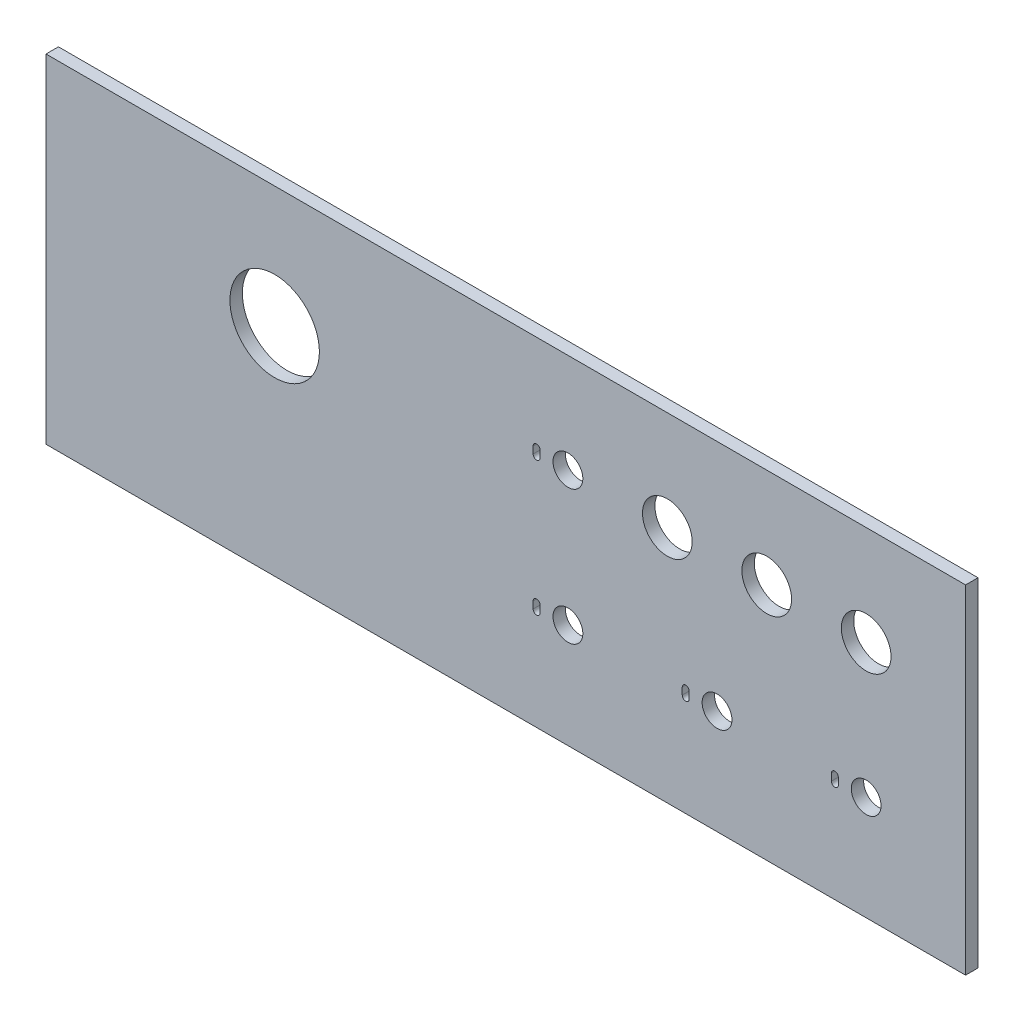
ISO-10303-21;
HEADER;
FILE_DESCRIPTION(('STEP AP214'),'2;1');
FILE_NAME('part.step','',(''),(''),'','','');
FILE_SCHEMA(('AUTOMOTIVE_DESIGN { 1 0 10303 214 1 1 1 1 }'));
ENDSEC;
DATA;
#1=APPLICATION_CONTEXT('core data for automotive mechanical design processes');
#2=APPLICATION_PROTOCOL_DEFINITION('international standard','automotive_design',2000,#1);
#3=PRODUCT_CONTEXT('',#1,'mechanical');
#4=PRODUCT('Part','Part','',(#3));
#5=PRODUCT_RELATED_PRODUCT_CATEGORY('part','',(#4));
#6=PRODUCT_DEFINITION_FORMATION('','',#4);
#7=PRODUCT_DEFINITION_CONTEXT('part definition',#1,'design');
#8=PRODUCT_DEFINITION('design','',#6,#7);
#9=PRODUCT_DEFINITION_SHAPE('','',#8);
#10=(LENGTH_UNIT() NAMED_UNIT(*) SI_UNIT(.MILLI.,.METRE.));
#11=(NAMED_UNIT(*) PLANE_ANGLE_UNIT() SI_UNIT($,.RADIAN.));
#12=(NAMED_UNIT(*) SI_UNIT($,.STERADIAN.) SOLID_ANGLE_UNIT());
#13=UNCERTAINTY_MEASURE_WITH_UNIT(LENGTH_MEASURE(1.E-05),#10,'distance_accuracy_value','');
#14=(GEOMETRIC_REPRESENTATION_CONTEXT(3) GLOBAL_UNCERTAINTY_ASSIGNED_CONTEXT((#13)) GLOBAL_UNIT_ASSIGNED_CONTEXT((#10,
#11,#12)) REPRESENTATION_CONTEXT('',''));
#15=CARTESIAN_POINT('',(0.,0.,0.));
#16=DIRECTION('',(0.,0.,1.));
#17=DIRECTION('',(1.,0.,0.));
#18=AXIS2_PLACEMENT_3D('',#15,#16,#17);
#19=CARTESIAN_POINT('',(117.475,-43.18,-3.175));
#20=DIRECTION('',(1.,0.,0.));
#21=DIRECTION('',(0.,0.,-1.));
#22=AXIS2_PLACEMENT_3D('',#19,#20,#21);
#23=PLANE('',#22);
#24=DIRECTION('',(0.,1.,0.));
#25=VECTOR('',#24,1.);
#26=CARTESIAN_POINT('',(117.475,-43.18,0.));
#27=LINE('',#26,#25);
#28=CARTESIAN_POINT('',(117.475,-43.18,0.));
#29=VERTEX_POINT('',#28);
#30=CARTESIAN_POINT('',(117.475,43.18,0.));
#31=VERTEX_POINT('',#30);
#32=EDGE_CURVE('E339',#29,#31,#27,.T.);
#33=ORIENTED_EDGE('',*,*,#32,.F.);
#34=DIRECTION('',(0.,0.,1.));
#35=VECTOR('',#34,1.);
#36=CARTESIAN_POINT('',(117.475,-43.18,-3.175));
#37=LINE('',#36,#35);
#38=CARTESIAN_POINT('',(117.475,-43.18,-3.175));
#39=VERTEX_POINT('',#38);
#40=EDGE_CURVE('E11',#39,#29,#37,.T.);
#41=ORIENTED_EDGE('',*,*,#40,.F.);
#42=DIRECTION('',(0.,1.,0.));
#43=VECTOR('',#42,1.);
#44=CARTESIAN_POINT('',(117.475,-43.18,-3.175));
#45=LINE('',#44,#43);
#46=CARTESIAN_POINT('',(117.475,43.18,-3.175));
#47=VERTEX_POINT('',#46);
#48=EDGE_CURVE('E354',#39,#47,#45,.T.);
#49=ORIENTED_EDGE('',*,*,#48,.T.);
#50=DIRECTION('',(0.,0.,1.));
#51=VECTOR('',#50,1.);
#52=CARTESIAN_POINT('',(117.475,43.18,-3.175));
#53=LINE('',#52,#51);
#54=EDGE_CURVE('E41',#47,#31,#53,.T.);
#55=ORIENTED_EDGE('',*,*,#54,.T.);
#56=EDGE_LOOP('',(#33,#41,#49,#55));
#57=FACE_BOUND('',#56,.T.);
#58=ADVANCED_FACE('F38',(#57),#23,.T.);
#59=CARTESIAN_POINT('',(-117.475,-43.18,-3.175));
#60=DIRECTION('',(0.,-1.,0.));
#61=DIRECTION('',(0.,0.,-1.));
#62=AXIS2_PLACEMENT_3D('',#59,#60,#61);
#63=PLANE('',#62);
#64=DIRECTION('',(1.,0.,0.));
#65=VECTOR('',#64,1.);
#66=CARTESIAN_POINT('',(-117.475,-43.18,0.));
#67=LINE('',#66,#65);
#68=CARTESIAN_POINT('',(-117.475,-43.18,0.));
#69=VERTEX_POINT('',#68);
#70=EDGE_CURVE('E358',#69,#29,#67,.T.);
#71=ORIENTED_EDGE('',*,*,#70,.F.);
#72=DIRECTION('',(0.,0.,1.));
#73=VECTOR('',#72,1.);
#74=CARTESIAN_POINT('',(-117.475,-43.18,-3.175));
#75=LINE('',#74,#73);
#76=CARTESIAN_POINT('',(-117.475,-43.18,-3.175));
#77=VERTEX_POINT('',#76);
#78=EDGE_CURVE('E46',#77,#69,#75,.T.);
#79=ORIENTED_EDGE('',*,*,#78,.F.);
#80=DIRECTION('',(1.,0.,0.));
#81=VECTOR('',#80,1.);
#82=CARTESIAN_POINT('',(-117.475,-43.18,-3.175));
#83=LINE('',#82,#81);
#84=EDGE_CURVE('E364',#77,#39,#83,.T.);
#85=ORIENTED_EDGE('',*,*,#84,.T.);
#86=ORIENTED_EDGE('',*,*,#40,.T.);
#87=EDGE_LOOP('',(#71,#79,#85,#86));
#88=FACE_BOUND('',#87,.T.);
#89=ADVANCED_FACE('F390',(#88),#63,.T.);
#90=CARTESIAN_POINT('',(-117.475,-43.18,-3.175));
#91=DIRECTION('',(-1.,0.,0.));
#92=DIRECTION('',(0.,0.,1.));
#93=AXIS2_PLACEMENT_3D('',#90,#91,#92);
#94=PLANE('',#93);
#95=DIRECTION('',(0.,-1.,0.));
#96=VECTOR('',#95,1.);
#97=CARTESIAN_POINT('',(-117.475,-43.18,0.));
#98=LINE('',#97,#96);
#99=CARTESIAN_POINT('',(-117.475,43.18,0.));
#100=VERTEX_POINT('',#99);
#101=EDGE_CURVE('E372',#100,#69,#98,.T.);
#102=ORIENTED_EDGE('',*,*,#101,.F.);
#103=DIRECTION('',(0.,0.,1.));
#104=VECTOR('',#103,1.);
#105=CARTESIAN_POINT('',(-117.475,43.18,-3.175));
#106=LINE('',#105,#104);
#107=CARTESIAN_POINT('',(-117.475,43.18,-3.175));
#108=VERTEX_POINT('',#107);
#109=EDGE_CURVE('E377',#108,#100,#106,.T.);
#110=ORIENTED_EDGE('',*,*,#109,.F.);
#111=DIRECTION('',(0.,-1.,0.));
#112=VECTOR('',#111,1.);
#113=CARTESIAN_POINT('',(-117.475,-43.18,-3.175));
#114=LINE('',#113,#112);
#115=EDGE_CURVE('E361',#108,#77,#114,.T.);
#116=ORIENTED_EDGE('',*,*,#115,.T.);
#117=ORIENTED_EDGE('',*,*,#78,.T.);
#118=EDGE_LOOP('',(#102,#110,#116,#117));
#119=FACE_BOUND('',#118,.T.);
#120=ADVANCED_FACE('F395',(#119),#94,.T.);
#121=CARTESIAN_POINT('',(-117.475,43.18,-3.175));
#122=DIRECTION('',(0.,1.,0.));
#123=DIRECTION('',(0.,0.,1.));
#124=AXIS2_PLACEMENT_3D('',#121,#122,#123);
#125=PLANE('',#124);
#126=DIRECTION('',(-1.,0.,0.));
#127=VECTOR('',#126,1.);
#128=CARTESIAN_POINT('',(-117.475,43.18,0.));
#129=LINE('',#128,#127);
#130=EDGE_CURVE('E369',#31,#100,#129,.T.);
#131=ORIENTED_EDGE('',*,*,#130,.F.);
#132=ORIENTED_EDGE('',*,*,#54,.F.);
#133=DIRECTION('',(-1.,0.,0.));
#134=VECTOR('',#133,1.);
#135=CARTESIAN_POINT('',(-117.475,43.18,-3.175));
#136=LINE('',#135,#134);
#137=EDGE_CURVE('E357',#47,#108,#136,.T.);
#138=ORIENTED_EDGE('',*,*,#137,.T.);
#139=ORIENTED_EDGE('',*,*,#109,.T.);
#140=EDGE_LOOP('',(#131,#132,#138,#139));
#141=FACE_BOUND('',#140,.T.);
#142=ADVANCED_FACE('F385',(#141),#125,.T.);
#143=CARTESIAN_POINT('',(0.,0.,-3.175));
#144=DIRECTION('',(0.,0.,-1.));
#145=DIRECTION('',(-1.,0.,0.));
#146=AXIS2_PLACEMENT_3D('',#143,#144,#145);
#147=PLANE('',#146);
#148=CARTESIAN_POINT('',(15.875,17.78,-3.175));
#149=DIRECTION('',(0.,0.,1.));
#150=DIRECTION('',(1.,0.,0.));
#151=AXIS2_PLACEMENT_3D('',#148,#149,#150);
#152=CIRCLE('',#151,3.81);
#153=CARTESIAN_POINT('',(19.685,17.78,-3.175));
#154=VERTEX_POINT('',#153);
#155=EDGE_CURVE('E221',#154,#154,#152,.T.);
#156=ORIENTED_EDGE('',*,*,#155,.T.);
#157=EDGE_LOOP('',(#156));
#158=FACE_BOUND('',#157,.T.);
#159=CARTESIAN_POINT('',(7.87399999999997,18.669,-3.175));
#160=DIRECTION('',(0.,0.,1.));
#161=DIRECTION('',(1.,0.,0.));
#162=AXIS2_PLACEMENT_3D('',#159,#160,#161);
#163=CIRCLE('',#162,0.889000000000001);
#164=CARTESIAN_POINT('',(8.76299999999997,18.669,-3.175));
#165=VERTEX_POINT('',#164);
#166=CARTESIAN_POINT('',(6.98499999999997,18.669,-3.175));
#167=VERTEX_POINT('',#166);
#168=EDGE_CURVE('E177',#165,#167,#163,.T.);
#169=ORIENTED_EDGE('',*,*,#168,.T.);
#170=DIRECTION('',(0.,-1.,0.));
#171=VECTOR('',#170,1.);
#172=CARTESIAN_POINT('',(6.98499999999997,18.669,-3.175));
#173=LINE('',#172,#171);
#174=CARTESIAN_POINT('',(6.98499999999997,16.891,-3.175));
#175=VERTEX_POINT('',#174);
#176=EDGE_CURVE('E186',#167,#175,#173,.T.);
#177=ORIENTED_EDGE('',*,*,#176,.T.);
#178=CARTESIAN_POINT('',(7.87399999999997,16.891,-3.175));
#179=DIRECTION('',(0.,0.,1.));
#180=DIRECTION('',(1.,0.,0.));
#181=AXIS2_PLACEMENT_3D('',#178,#179,#180);
#182=CIRCLE('',#181,0.889000000000001);
#183=CARTESIAN_POINT('',(8.76299999999997,16.891,-3.175));
#184=VERTEX_POINT('',#183);
#185=EDGE_CURVE('E54',#175,#184,#182,.T.);
#186=ORIENTED_EDGE('',*,*,#185,.T.);
#187=DIRECTION('',(0.,1.,0.));
#188=VECTOR('',#187,1.);
#189=CARTESIAN_POINT('',(8.76299999999997,18.669,-3.175));
#190=LINE('',#189,#188);
#191=EDGE_CURVE('E183',#184,#165,#190,.T.);
#192=ORIENTED_EDGE('',*,*,#191,.T.);
#193=EDGE_LOOP('',(#169,#177,#186,#192));
#194=FACE_BOUND('',#193,.T.);
#195=CARTESIAN_POINT('',(-59.055,12.192,-3.175));
#196=DIRECTION('',(0.,0.,1.));
#197=DIRECTION('',(1.,0.,0.));
#198=AXIS2_PLACEMENT_3D('',#195,#196,#197);
#199=CIRCLE('',#198,11.43);
#200=CARTESIAN_POINT('',(-47.625,12.192,-3.175));
#201=VERTEX_POINT('',#200);
#202=EDGE_CURVE('E214',#201,#201,#199,.T.);
#203=ORIENTED_EDGE('',*,*,#202,.T.);
#204=EDGE_LOOP('',(#203));
#205=FACE_BOUND('',#204,.T.);
#206=CARTESIAN_POINT('',(92.075,-16.51,-3.175));
#207=DIRECTION('',(0.,0.,1.));
#208=DIRECTION('',(1.,0.,0.));
#209=AXIS2_PLACEMENT_3D('',#206,#207,#208);
#210=CIRCLE('',#209,3.81000000000001);
#211=CARTESIAN_POINT('',(95.885,-16.51,-3.175));
#212=VERTEX_POINT('',#211);
#213=EDGE_CURVE('E222',#212,#212,#210,.T.);
#214=ORIENTED_EDGE('',*,*,#213,.T.);
#215=EDGE_LOOP('',(#214));
#216=FACE_BOUND('',#215,.T.);
#217=CARTESIAN_POINT('',(45.974,-15.621,-3.175));
#218=DIRECTION('',(0.,0.,1.));
#219=DIRECTION('',(1.,0.,0.));
#220=AXIS2_PLACEMENT_3D('',#217,#218,#219);
#221=CIRCLE('',#220,0.889000000000001);
#222=CARTESIAN_POINT('',(46.863,-15.621,-3.175));
#223=VERTEX_POINT('',#222);
#224=CARTESIAN_POINT('',(45.085,-15.621,-3.175));
#225=VERTEX_POINT('',#224);
#226=EDGE_CURVE('E264',#223,#225,#221,.T.);
#227=ORIENTED_EDGE('',*,*,#226,.T.);
#228=DIRECTION('',(0.,-1.,0.));
#229=VECTOR('',#228,1.);
#230=CARTESIAN_POINT('',(45.085,-15.621,-3.175));
#231=LINE('',#230,#229);
#232=CARTESIAN_POINT('',(45.085,-17.399,-3.175));
#233=VERTEX_POINT('',#232);
#234=EDGE_CURVE('E267',#225,#233,#231,.T.);
#235=ORIENTED_EDGE('',*,*,#234,.T.);
#236=CARTESIAN_POINT('',(45.974,-17.399,-3.175));
#237=DIRECTION('',(0.,0.,1.));
#238=DIRECTION('',(1.,0.,0.));
#239=AXIS2_PLACEMENT_3D('',#236,#237,#238);
#240=CIRCLE('',#239,0.889000000000001);
#241=CARTESIAN_POINT('',(46.863,-17.399,-3.175));
#242=VERTEX_POINT('',#241);
#243=EDGE_CURVE('E271',#233,#242,#240,.T.);
#244=ORIENTED_EDGE('',*,*,#243,.T.);
#245=DIRECTION('',(0.,1.,0.));
#246=VECTOR('',#245,1.);
#247=CARTESIAN_POINT('',(46.863,-15.621,-3.175));
#248=LINE('',#247,#246);
#249=EDGE_CURVE('E274',#242,#223,#248,.T.);
#250=ORIENTED_EDGE('',*,*,#249,.T.);
#251=EDGE_LOOP('',(#227,#235,#244,#250));
#252=FACE_BOUND('',#251,.T.);
#253=CARTESIAN_POINT('',(7.87399999999999,-15.621,-3.175));
#254=DIRECTION('',(0.,0.,1.));
#255=DIRECTION('',(1.,0.,0.));
#256=AXIS2_PLACEMENT_3D('',#253,#254,#255);
#257=CIRCLE('',#256,0.888999999999997);
#258=CARTESIAN_POINT('',(8.76299999999999,-15.621,-3.175));
#259=VERTEX_POINT('',#258);
#260=CARTESIAN_POINT('',(6.985,-15.621,-3.175));
#261=VERTEX_POINT('',#260);
#262=EDGE_CURVE('E230',#259,#261,#257,.T.);
#263=ORIENTED_EDGE('',*,*,#262,.T.);
#264=DIRECTION('',(0.,-1.,0.));
#265=VECTOR('',#264,1.);
#266=CARTESIAN_POINT('',(6.985,-15.621,-3.175));
#267=LINE('',#266,#265);
#268=CARTESIAN_POINT('',(6.985,-17.399,-3.175));
#269=VERTEX_POINT('',#268);
#270=EDGE_CURVE('E233',#261,#269,#267,.T.);
#271=ORIENTED_EDGE('',*,*,#270,.T.);
#272=CARTESIAN_POINT('',(7.87399999999999,-17.399,-3.175));
#273=DIRECTION('',(0.,0.,1.));
#274=DIRECTION('',(1.,0.,0.));
#275=AXIS2_PLACEMENT_3D('',#272,#273,#274);
#276=CIRCLE('',#275,0.888999999999997);
#277=CARTESIAN_POINT('',(8.76299999999999,-17.399,-3.175));
#278=VERTEX_POINT('',#277);
#279=EDGE_CURVE('E237',#269,#278,#276,.T.);
#280=ORIENTED_EDGE('',*,*,#279,.T.);
#281=DIRECTION('',(0.,1.,0.));
#282=VECTOR('',#281,1.);
#283=CARTESIAN_POINT('',(8.76299999999999,-15.621,-3.175));
#284=LINE('',#283,#282);
#285=EDGE_CURVE('E240',#278,#259,#284,.T.);
#286=ORIENTED_EDGE('',*,*,#285,.T.);
#287=EDGE_LOOP('',(#263,#271,#280,#286));
#288=FACE_BOUND('',#287,.T.);
#289=CARTESIAN_POINT('',(15.875,-16.51,-3.175));
#290=DIRECTION('',(0.,0.,1.));
#291=DIRECTION('',(1.,0.,0.));
#292=AXIS2_PLACEMENT_3D('',#289,#290,#291);
#293=CIRCLE('',#292,3.81);
#294=CARTESIAN_POINT('',(19.685,-16.51,-3.175));
#295=VERTEX_POINT('',#294);
#296=EDGE_CURVE('E301',#295,#295,#293,.T.);
#297=ORIENTED_EDGE('',*,*,#296,.T.);
#298=EDGE_LOOP('',(#297));
#299=FACE_BOUND('',#298,.T.);
#300=CARTESIAN_POINT('',(53.975,-16.51,-3.175));
#301=DIRECTION('',(0.,0.,1.));
#302=DIRECTION('',(1.,0.,0.));
#303=AXIS2_PLACEMENT_3D('',#300,#301,#302);
#304=CIRCLE('',#303,3.81000000000001);
#305=CARTESIAN_POINT('',(57.785,-16.51,-3.175));
#306=VERTEX_POINT('',#305);
#307=EDGE_CURVE('E229',#306,#306,#304,.T.);
#308=ORIENTED_EDGE('',*,*,#307,.T.);
#309=EDGE_LOOP('',(#308));
#310=FACE_BOUND('',#309,.T.);
#311=CARTESIAN_POINT('',(84.0739999999999,-15.621,-3.175));
#312=DIRECTION('',(0.,0.,1.));
#313=DIRECTION('',(1.,0.,0.));
#314=AXIS2_PLACEMENT_3D('',#311,#312,#313);
#315=CIRCLE('',#314,0.889000000000015);
#316=CARTESIAN_POINT('',(84.963,-15.621,-3.175));
#317=VERTEX_POINT('',#316);
#318=CARTESIAN_POINT('',(83.1849999999999,-15.621,-3.175));
#319=VERTEX_POINT('',#318);
#320=EDGE_CURVE('E306',#317,#319,#315,.T.);
#321=ORIENTED_EDGE('',*,*,#320,.T.);
#322=DIRECTION('',(0.,-1.,0.));
#323=VECTOR('',#322,1.);
#324=CARTESIAN_POINT('',(83.1849999999999,-15.621,-3.175));
#325=LINE('',#324,#323);
#326=CARTESIAN_POINT('',(83.1849999999999,-17.399,-3.175));
#327=VERTEX_POINT('',#326);
#328=EDGE_CURVE('E309',#319,#327,#325,.T.);
#329=ORIENTED_EDGE('',*,*,#328,.T.);
#330=CARTESIAN_POINT('',(84.0739999999999,-17.399,-3.175));
#331=DIRECTION('',(0.,0.,1.));
#332=DIRECTION('',(1.,0.,0.));
#333=AXIS2_PLACEMENT_3D('',#330,#331,#332);
#334=CIRCLE('',#333,0.889000000000015);
#335=CARTESIAN_POINT('',(84.963,-17.399,-3.175));
#336=VERTEX_POINT('',#335);
#337=EDGE_CURVE('E313',#327,#336,#334,.T.);
#338=ORIENTED_EDGE('',*,*,#337,.T.);
#339=DIRECTION('',(0.,1.,0.));
#340=VECTOR('',#339,1.);
#341=CARTESIAN_POINT('',(84.963,-15.621,-3.175));
#342=LINE('',#341,#340);
#343=EDGE_CURVE('E316',#336,#317,#342,.T.);
#344=ORIENTED_EDGE('',*,*,#343,.T.);
#345=EDGE_LOOP('',(#321,#329,#338,#344));
#346=FACE_BOUND('',#345,.T.);
#347=CARTESIAN_POINT('',(41.275,17.78,-3.175));
#348=DIRECTION('',(0.,0.,1.));
#349=DIRECTION('',(1.,0.,0.));
#350=AXIS2_PLACEMENT_3D('',#347,#348,#349);
#351=CIRCLE('',#350,6.35);
#352=CARTESIAN_POINT('',(47.625,17.78,-3.175));
#353=VERTEX_POINT('',#352);
#354=EDGE_CURVE('E336',#353,#353,#351,.T.);
#355=ORIENTED_EDGE('',*,*,#354,.T.);
#356=EDGE_LOOP('',(#355));
#357=FACE_BOUND('',#356,.T.);
#358=CARTESIAN_POINT('',(66.675,17.78,-3.175));
#359=DIRECTION('',(0.,0.,1.));
#360=DIRECTION('',(1.,0.,0.));
#361=AXIS2_PLACEMENT_3D('',#358,#359,#360);
#362=CIRCLE('',#361,6.35);
#363=CARTESIAN_POINT('',(73.025,17.78,-3.175));
#364=VERTEX_POINT('',#363);
#365=EDGE_CURVE('E343',#364,#364,#362,.T.);
#366=ORIENTED_EDGE('',*,*,#365,.T.);
#367=EDGE_LOOP('',(#366));
#368=FACE_BOUND('',#367,.T.);
#369=CARTESIAN_POINT('',(92.075,17.78,-3.175));
#370=DIRECTION('',(0.,0.,1.));
#371=DIRECTION('',(1.,0.,0.));
#372=AXIS2_PLACEMENT_3D('',#369,#370,#371);
#373=CIRCLE('',#372,6.35);
#374=CARTESIAN_POINT('',(98.425,17.78,-3.175));
#375=VERTEX_POINT('',#374);
#376=EDGE_CURVE('E349',#375,#375,#373,.T.);
#377=ORIENTED_EDGE('',*,*,#376,.T.);
#378=EDGE_LOOP('',(#377));
#379=FACE_BOUND('',#378,.T.);
#380=ORIENTED_EDGE('',*,*,#48,.F.);
#381=ORIENTED_EDGE('',*,*,#84,.F.);
#382=ORIENTED_EDGE('',*,*,#115,.F.);
#383=ORIENTED_EDGE('',*,*,#137,.F.);
#384=EDGE_LOOP('',(#380,#381,#382,#383));
#385=FACE_BOUND('',#384,.T.);
#386=ADVANCED_FACE('F190',(#158,#194,#205,#216,#252,#288,#299,#310,#346,#357,#368,#379,#385),
#147,.T.);
#387=CARTESIAN_POINT('',(0.,0.,0.));
#388=DIRECTION('',(0.,0.,-1.));
#389=DIRECTION('',(-1.,0.,0.));
#390=AXIS2_PLACEMENT_3D('',#387,#388,#389);
#391=PLANE('',#390);
#392=CARTESIAN_POINT('',(15.875,17.78,0.));
#393=DIRECTION('',(0.,0.,1.));
#394=DIRECTION('',(1.,0.,0.));
#395=AXIS2_PLACEMENT_3D('',#392,#393,#394);
#396=CIRCLE('',#395,3.81);
#397=CARTESIAN_POINT('',(19.685,17.78,0.));
#398=VERTEX_POINT('',#397);
#399=EDGE_CURVE('E199',#398,#398,#396,.T.);
#400=ORIENTED_EDGE('',*,*,#399,.F.);
#401=EDGE_LOOP('',(#400));
#402=FACE_BOUND('',#401,.T.);
#403=DIRECTION('',(0.,-1.,0.));
#404=VECTOR('',#403,1.);
#405=CARTESIAN_POINT('',(6.98499999999997,18.669,0.));
#406=LINE('',#405,#404);
#407=CARTESIAN_POINT('',(6.98499999999997,18.669,0.));
#408=VERTEX_POINT('',#407);
#409=CARTESIAN_POINT('',(6.98499999999997,16.891,0.));
#410=VERTEX_POINT('',#409);
#411=EDGE_CURVE('E205',#408,#410,#406,.T.);
#412=ORIENTED_EDGE('',*,*,#411,.F.);
#413=CARTESIAN_POINT('',(7.87399999999997,18.669,0.));
#414=DIRECTION('',(0.,0.,1.));
#415=DIRECTION('',(1.,0.,0.));
#416=AXIS2_PLACEMENT_3D('',#413,#414,#415);
#417=CIRCLE('',#416,0.889000000000001);
#418=CARTESIAN_POINT('',(8.76299999999997,18.669,0.));
#419=VERTEX_POINT('',#418);
#420=EDGE_CURVE('E62',#419,#408,#417,.T.);
#421=ORIENTED_EDGE('',*,*,#420,.F.);
#422=DIRECTION('',(0.,1.,0.));
#423=VECTOR('',#422,1.);
#424=CARTESIAN_POINT('',(8.76299999999997,18.669,0.));
#425=LINE('',#424,#423);
#426=CARTESIAN_POINT('',(8.76299999999997,16.891,0.));
#427=VERTEX_POINT('',#426);
#428=EDGE_CURVE('E193',#427,#419,#425,.T.);
#429=ORIENTED_EDGE('',*,*,#428,.F.);
#430=CARTESIAN_POINT('',(7.87399999999997,16.891,0.));
#431=DIRECTION('',(0.,0.,1.));
#432=DIRECTION('',(1.,0.,0.));
#433=AXIS2_PLACEMENT_3D('',#430,#431,#432);
#434=CIRCLE('',#433,0.889000000000001);
#435=EDGE_CURVE('E196',#410,#427,#434,.T.);
#436=ORIENTED_EDGE('',*,*,#435,.F.);
#437=EDGE_LOOP('',(#412,#421,#429,#436));
#438=FACE_BOUND('',#437,.T.);
#439=CARTESIAN_POINT('',(-59.055,12.192,0.));
#440=DIRECTION('',(0.,0.,1.));
#441=DIRECTION('',(1.,0.,0.));
#442=AXIS2_PLACEMENT_3D('',#439,#440,#441);
#443=CIRCLE('',#442,11.43);
#444=CARTESIAN_POINT('',(-47.625,12.192,0.));
#445=VERTEX_POINT('',#444);
#446=EDGE_CURVE('E218',#445,#445,#443,.T.);
#447=ORIENTED_EDGE('',*,*,#446,.F.);
#448=EDGE_LOOP('',(#447));
#449=FACE_BOUND('',#448,.T.);
#450=CARTESIAN_POINT('',(92.075,-16.51,0.));
#451=DIRECTION('',(0.,0.,1.));
#452=DIRECTION('',(1.,0.,0.));
#453=AXIS2_PLACEMENT_3D('',#450,#451,#452);
#454=CIRCLE('',#453,3.81000000000001);
#455=CARTESIAN_POINT('',(95.885,-16.51,0.));
#456=VERTEX_POINT('',#455);
#457=EDGE_CURVE('E226',#456,#456,#454,.T.);
#458=ORIENTED_EDGE('',*,*,#457,.F.);
#459=EDGE_LOOP('',(#458));
#460=FACE_BOUND('',#459,.T.);
#461=DIRECTION('',(0.,-1.,0.));
#462=VECTOR('',#461,1.);
#463=CARTESIAN_POINT('',(45.085,-15.621,0.));
#464=LINE('',#463,#462);
#465=CARTESIAN_POINT('',(45.085,-15.621,0.));
#466=VERTEX_POINT('',#465);
#467=CARTESIAN_POINT('',(45.085,-17.399,0.));
#468=VERTEX_POINT('',#467);
#469=EDGE_CURVE('E280',#466,#468,#464,.T.);
#470=ORIENTED_EDGE('',*,*,#469,.F.);
#471=CARTESIAN_POINT('',(45.974,-15.621,0.));
#472=DIRECTION('',(0.,0.,1.));
#473=DIRECTION('',(1.,0.,0.));
#474=AXIS2_PLACEMENT_3D('',#471,#472,#473);
#475=CIRCLE('',#474,0.889000000000001);
#476=CARTESIAN_POINT('',(46.863,-15.621,0.));
#477=VERTEX_POINT('',#476);
#478=EDGE_CURVE('E278',#477,#466,#475,.T.);
#479=ORIENTED_EDGE('',*,*,#478,.F.);
#480=DIRECTION('',(0.,1.,0.));
#481=VECTOR('',#480,1.);
#482=CARTESIAN_POINT('',(46.863,-15.621,0.));
#483=LINE('',#482,#481);
#484=CARTESIAN_POINT('',(46.863,-17.399,0.));
#485=VERTEX_POINT('',#484);
#486=EDGE_CURVE('E268',#485,#477,#483,.T.);
#487=ORIENTED_EDGE('',*,*,#486,.F.);
#488=CARTESIAN_POINT('',(45.974,-17.399,0.));
#489=DIRECTION('',(0.,0.,1.));
#490=DIRECTION('',(1.,0.,0.));
#491=AXIS2_PLACEMENT_3D('',#488,#489,#490);
#492=CIRCLE('',#491,0.889000000000001);
#493=EDGE_CURVE('E284',#468,#485,#492,.T.);
#494=ORIENTED_EDGE('',*,*,#493,.F.);
#495=EDGE_LOOP('',(#470,#479,#487,#494));
#496=FACE_BOUND('',#495,.T.);
#497=DIRECTION('',(0.,-1.,0.));
#498=VECTOR('',#497,1.);
#499=CARTESIAN_POINT('',(6.985,-15.621,0.));
#500=LINE('',#499,#498);
#501=CARTESIAN_POINT('',(6.985,-15.621,0.));
#502=VERTEX_POINT('',#501);
#503=CARTESIAN_POINT('',(6.98499999999999,-17.399,0.));
#504=VERTEX_POINT('',#503);
#505=EDGE_CURVE('E246',#502,#504,#500,.T.);
#506=ORIENTED_EDGE('',*,*,#505,.F.);
#507=CARTESIAN_POINT('',(7.87399999999999,-15.621,0.));
#508=DIRECTION('',(0.,0.,1.));
#509=DIRECTION('',(1.,0.,0.));
#510=AXIS2_PLACEMENT_3D('',#507,#508,#509);
#511=CIRCLE('',#510,0.888999999999997);
#512=CARTESIAN_POINT('',(8.76299999999999,-15.621,0.));
#513=VERTEX_POINT('',#512);
#514=EDGE_CURVE('E244',#513,#502,#511,.T.);
#515=ORIENTED_EDGE('',*,*,#514,.F.);
#516=DIRECTION('',(0.,1.,0.));
#517=VECTOR('',#516,1.);
#518=CARTESIAN_POINT('',(8.76299999999999,-15.621,0.));
#519=LINE('',#518,#517);
#520=CARTESIAN_POINT('',(8.76299999999999,-17.399,0.));
#521=VERTEX_POINT('',#520);
#522=EDGE_CURVE('E234',#521,#513,#519,.T.);
#523=ORIENTED_EDGE('',*,*,#522,.F.);
#524=CARTESIAN_POINT('',(7.87399999999999,-17.399,0.));
#525=DIRECTION('',(0.,0.,1.));
#526=DIRECTION('',(1.,0.,0.));
#527=AXIS2_PLACEMENT_3D('',#524,#525,#526);
#528=CIRCLE('',#527,0.888999999999997);
#529=EDGE_CURVE('E250',#504,#521,#528,.T.);
#530=ORIENTED_EDGE('',*,*,#529,.F.);
#531=EDGE_LOOP('',(#506,#515,#523,#530));
#532=FACE_BOUND('',#531,.T.);
#533=CARTESIAN_POINT('',(15.875,-16.51,0.));
#534=DIRECTION('',(0.,0.,1.));
#535=DIRECTION('',(1.,0.,0.));
#536=AXIS2_PLACEMENT_3D('',#533,#534,#535);
#537=CIRCLE('',#536,3.81);
#538=CARTESIAN_POINT('',(19.685,-16.51,0.));
#539=VERTEX_POINT('',#538);
#540=EDGE_CURVE('E257',#539,#539,#537,.T.);
#541=ORIENTED_EDGE('',*,*,#540,.F.);
#542=EDGE_LOOP('',(#541));
#543=FACE_BOUND('',#542,.T.);
#544=CARTESIAN_POINT('',(53.975,-16.51,0.));
#545=DIRECTION('',(0.,0.,1.));
#546=DIRECTION('',(1.,0.,0.));
#547=AXIS2_PLACEMENT_3D('',#544,#545,#546);
#548=CIRCLE('',#547,3.81000000000001);
#549=CARTESIAN_POINT('',(57.785,-16.51,0.));
#550=VERTEX_POINT('',#549);
#551=EDGE_CURVE('E298',#550,#550,#548,.T.);
#552=ORIENTED_EDGE('',*,*,#551,.F.);
#553=EDGE_LOOP('',(#552));
#554=FACE_BOUND('',#553,.T.);
#555=DIRECTION('',(0.,-1.,0.));
#556=VECTOR('',#555,1.);
#557=CARTESIAN_POINT('',(83.1849999999999,-15.621,0.));
#558=LINE('',#557,#556);
#559=CARTESIAN_POINT('',(83.1849999999999,-15.621,0.));
#560=VERTEX_POINT('',#559);
#561=CARTESIAN_POINT('',(83.1849999999999,-17.399,0.));
#562=VERTEX_POINT('',#561);
#563=EDGE_CURVE('E321',#560,#562,#558,.T.);
#564=ORIENTED_EDGE('',*,*,#563,.F.);
#565=CARTESIAN_POINT('',(84.0739999999999,-15.621,0.));
#566=DIRECTION('',(0.,0.,1.));
#567=DIRECTION('',(1.,0.,0.));
#568=AXIS2_PLACEMENT_3D('',#565,#566,#567);
#569=CIRCLE('',#568,0.889000000000015);
#570=CARTESIAN_POINT('',(84.963,-15.621,0.));
#571=VERTEX_POINT('',#570);
#572=EDGE_CURVE('E217',#571,#560,#569,.T.);
#573=ORIENTED_EDGE('',*,*,#572,.F.);
#574=DIRECTION('',(0.,1.,0.));
#575=VECTOR('',#574,1.);
#576=CARTESIAN_POINT('',(84.963,-15.621,0.));
#577=LINE('',#576,#575);
#578=CARTESIAN_POINT('',(84.963,-17.399,0.));
#579=VERTEX_POINT('',#578);
#580=EDGE_CURVE('E310',#579,#571,#577,.T.);
#581=ORIENTED_EDGE('',*,*,#580,.F.);
#582=CARTESIAN_POINT('',(84.0739999999999,-17.399,0.));
#583=DIRECTION('',(0.,0.,1.));
#584=DIRECTION('',(1.,0.,0.));
#585=AXIS2_PLACEMENT_3D('',#582,#583,#584);
#586=CIRCLE('',#585,0.889000000000015);
#587=EDGE_CURVE('E324',#562,#579,#586,.T.);
#588=ORIENTED_EDGE('',*,*,#587,.F.);
#589=EDGE_LOOP('',(#564,#573,#581,#588));
#590=FACE_BOUND('',#589,.T.);
#591=CARTESIAN_POINT('',(41.275,17.78,0.));
#592=DIRECTION('',(0.,0.,1.));
#593=DIRECTION('',(1.,0.,0.));
#594=AXIS2_PLACEMENT_3D('',#591,#592,#593);
#595=CIRCLE('',#594,6.35);
#596=CARTESIAN_POINT('',(47.625,17.78,0.));
#597=VERTEX_POINT('',#596);
#598=EDGE_CURVE('E340',#597,#597,#595,.T.);
#599=ORIENTED_EDGE('',*,*,#598,.F.);
#600=EDGE_LOOP('',(#599));
#601=FACE_BOUND('',#600,.T.);
#602=CARTESIAN_POINT('',(66.675,17.78,0.));
#603=DIRECTION('',(0.,0.,1.));
#604=DIRECTION('',(1.,0.,0.));
#605=AXIS2_PLACEMENT_3D('',#602,#603,#604);
#606=CIRCLE('',#605,6.35);
#607=CARTESIAN_POINT('',(73.025,17.78,0.));
#608=VERTEX_POINT('',#607);
#609=EDGE_CURVE('E346',#608,#608,#606,.T.);
#610=ORIENTED_EDGE('',*,*,#609,.F.);
#611=EDGE_LOOP('',(#610));
#612=FACE_BOUND('',#611,.T.);
#613=CARTESIAN_POINT('',(92.075,17.78,0.));
#614=DIRECTION('',(0.,0.,1.));
#615=DIRECTION('',(1.,0.,0.));
#616=AXIS2_PLACEMENT_3D('',#613,#614,#615);
#617=CIRCLE('',#616,6.35);
#618=CARTESIAN_POINT('',(98.425,17.78,0.));
#619=VERTEX_POINT('',#618);
#620=EDGE_CURVE('E225',#619,#619,#617,.T.);
#621=ORIENTED_EDGE('',*,*,#620,.F.);
#622=EDGE_LOOP('',(#621));
#623=FACE_BOUND('',#622,.T.);
#624=ORIENTED_EDGE('',*,*,#32,.T.);
#625=ORIENTED_EDGE('',*,*,#130,.T.);
#626=ORIENTED_EDGE('',*,*,#101,.T.);
#627=ORIENTED_EDGE('',*,*,#70,.T.);
#628=EDGE_LOOP('',(#624,#625,#626,#627));
#629=FACE_BOUND('',#628,.T.);
#630=ADVANCED_FACE('F387',(#402,#438,#449,#460,#496,#532,#543,#554,#590,#601,#612,#623,#629),
#391,.F.);
#631=CARTESIAN_POINT('',(92.075,17.78,-3.175));
#632=DIRECTION('',(0.,0.,1.));
#633=DIRECTION('',(1.,0.,0.));
#634=AXIS2_PLACEMENT_3D('',#631,#632,#633);
#635=CYLINDRICAL_SURFACE('',#634,6.35);
#636=ORIENTED_EDGE('',*,*,#376,.F.);
#637=EDGE_LOOP('',(#636));
#638=FACE_BOUND('',#637,.T.);
#639=ORIENTED_EDGE('',*,*,#620,.T.);
#640=EDGE_LOOP('',(#639));
#641=FACE_BOUND('',#640,.T.);
#642=ADVANCED_FACE('F430',(#638,#641),#635,.F.);
#643=CARTESIAN_POINT('',(66.675,17.78,-3.175));
#644=DIRECTION('',(0.,0.,1.));
#645=DIRECTION('',(1.,0.,0.));
#646=AXIS2_PLACEMENT_3D('',#643,#644,#645);
#647=CYLINDRICAL_SURFACE('',#646,6.35);
#648=ORIENTED_EDGE('',*,*,#365,.F.);
#649=EDGE_LOOP('',(#648));
#650=FACE_BOUND('',#649,.T.);
#651=ORIENTED_EDGE('',*,*,#609,.T.);
#652=EDGE_LOOP('',(#651));
#653=FACE_BOUND('',#652,.T.);
#654=ADVANCED_FACE('F435',(#650,#653),#647,.F.);
#655=CARTESIAN_POINT('',(41.275,17.78,-3.175));
#656=DIRECTION('',(0.,0.,1.));
#657=DIRECTION('',(1.,0.,0.));
#658=AXIS2_PLACEMENT_3D('',#655,#656,#657);
#659=CYLINDRICAL_SURFACE('',#658,6.35);
#660=ORIENTED_EDGE('',*,*,#354,.F.);
#661=EDGE_LOOP('',(#660));
#662=FACE_BOUND('',#661,.T.);
#663=ORIENTED_EDGE('',*,*,#598,.T.);
#664=EDGE_LOOP('',(#663));
#665=FACE_BOUND('',#664,.T.);
#666=ADVANCED_FACE('F448',(#662,#665),#659,.F.);
#667=CARTESIAN_POINT('',(84.0739999999999,-15.621,-3.175));
#668=DIRECTION('',(0.,0.,1.));
#669=DIRECTION('',(1.,0.,0.));
#670=AXIS2_PLACEMENT_3D('',#667,#668,#669);
#671=CYLINDRICAL_SURFACE('',#670,0.889000000000015);
#672=ORIENTED_EDGE('',*,*,#572,.T.);
#673=DIRECTION('',(0.,0.,1.));
#674=VECTOR('',#673,1.);
#675=CARTESIAN_POINT('',(83.1849999999999,-15.621,-3.175));
#676=LINE('',#675,#674);
#677=EDGE_CURVE('E319',#319,#560,#676,.T.);
#678=ORIENTED_EDGE('',*,*,#677,.F.);
#679=ORIENTED_EDGE('',*,*,#320,.F.);
#680=DIRECTION('',(0.,0.,1.));
#681=VECTOR('',#680,1.);
#682=CARTESIAN_POINT('',(84.963,-15.621,-3.175));
#683=LINE('',#682,#681);
#684=EDGE_CURVE('E281',#317,#571,#683,.T.);
#685=ORIENTED_EDGE('',*,*,#684,.T.);
#686=EDGE_LOOP('',(#672,#678,#679,#685));
#687=FACE_BOUND('',#686,.T.);
#688=ADVANCED_FACE('F459',(#687),#671,.F.);
#689=CARTESIAN_POINT('',(84.963,-15.621,-3.175));
#690=DIRECTION('',(1.,0.,0.));
#691=DIRECTION('',(0.,0.,-1.));
#692=AXIS2_PLACEMENT_3D('',#689,#690,#691);
#693=PLANE('',#692);
#694=ORIENTED_EDGE('',*,*,#580,.T.);
#695=ORIENTED_EDGE('',*,*,#684,.F.);
#696=ORIENTED_EDGE('',*,*,#343,.F.);
#697=DIRECTION('',(0.,0.,1.));
#698=VECTOR('',#697,1.);
#699=CARTESIAN_POINT('',(84.963,-17.399,-3.175));
#700=LINE('',#699,#698);
#701=EDGE_CURVE('E330',#336,#579,#700,.T.);
#702=ORIENTED_EDGE('',*,*,#701,.T.);
#703=EDGE_LOOP('',(#694,#695,#696,#702));
#704=FACE_BOUND('',#703,.T.);
#705=ADVANCED_FACE('F470',(#704),#693,.F.);
#706=CARTESIAN_POINT('',(84.0739999999999,-17.399,-3.175));
#707=DIRECTION('',(0.,0.,1.));
#708=DIRECTION('',(1.,0.,0.));
#709=AXIS2_PLACEMENT_3D('',#706,#707,#708);
#710=CYLINDRICAL_SURFACE('',#709,0.889000000000015);
#711=ORIENTED_EDGE('',*,*,#587,.T.);
#712=ORIENTED_EDGE('',*,*,#701,.F.);
#713=ORIENTED_EDGE('',*,*,#337,.F.);
#714=DIRECTION('',(0.,0.,1.));
#715=VECTOR('',#714,1.);
#716=CARTESIAN_POINT('',(83.1849999999999,-17.399,-3.175));
#717=LINE('',#716,#715);
#718=EDGE_CURVE('E332',#327,#562,#717,.T.);
#719=ORIENTED_EDGE('',*,*,#718,.T.);
#720=EDGE_LOOP('',(#711,#712,#713,#719));
#721=FACE_BOUND('',#720,.T.);
#722=ADVANCED_FACE('F481',(#721),#710,.F.);
#723=CARTESIAN_POINT('',(83.1849999999999,-15.621,-3.175));
#724=DIRECTION('',(-1.,0.,0.));
#725=DIRECTION('',(0.,0.,1.));
#726=AXIS2_PLACEMENT_3D('',#723,#724,#725);
#727=PLANE('',#726);
#728=ORIENTED_EDGE('',*,*,#563,.T.);
#729=ORIENTED_EDGE('',*,*,#718,.F.);
#730=ORIENTED_EDGE('',*,*,#328,.F.);
#731=ORIENTED_EDGE('',*,*,#677,.T.);
#732=EDGE_LOOP('',(#728,#729,#730,#731));
#733=FACE_BOUND('',#732,.T.);
#734=ADVANCED_FACE('F492',(#733),#727,.F.);
#735=CARTESIAN_POINT('',(53.975,-16.51,-3.175));
#736=DIRECTION('',(0.,0.,1.));
#737=DIRECTION('',(1.,0.,0.));
#738=AXIS2_PLACEMENT_3D('',#735,#736,#737);
#739=CYLINDRICAL_SURFACE('',#738,3.81000000000001);
#740=ORIENTED_EDGE('',*,*,#307,.F.);
#741=EDGE_LOOP('',(#740));
#742=FACE_BOUND('',#741,.T.);
#743=ORIENTED_EDGE('',*,*,#551,.T.);
#744=EDGE_LOOP('',(#743));
#745=FACE_BOUND('',#744,.T.);
#746=ADVANCED_FACE('F503',(#742,#745),#739,.F.);
#747=CARTESIAN_POINT('',(15.875,-16.51,-3.175));
#748=DIRECTION('',(0.,0.,1.));
#749=DIRECTION('',(1.,0.,0.));
#750=AXIS2_PLACEMENT_3D('',#747,#748,#749);
#751=CYLINDRICAL_SURFACE('',#750,3.81);
#752=ORIENTED_EDGE('',*,*,#296,.F.);
#753=EDGE_LOOP('',(#752));
#754=FACE_BOUND('',#753,.T.);
#755=ORIENTED_EDGE('',*,*,#540,.T.);
#756=EDGE_LOOP('',(#755));
#757=FACE_BOUND('',#756,.T.);
#758=ADVANCED_FACE('F514',(#754,#757),#751,.F.);
#759=CARTESIAN_POINT('',(7.87399999999999,-15.621,-3.175));
#760=DIRECTION('',(0.,0.,1.));
#761=DIRECTION('',(1.,0.,0.));
#762=AXIS2_PLACEMENT_3D('',#759,#760,#761);
#763=CYLINDRICAL_SURFACE('',#762,0.888999999999997);
#764=ORIENTED_EDGE('',*,*,#514,.T.);
#765=DIRECTION('',(0.,0.,1.));
#766=VECTOR('',#765,1.);
#767=CARTESIAN_POINT('',(6.985,-15.621,-3.175));
#768=LINE('',#767,#766);
#769=EDGE_CURVE('E243',#261,#502,#768,.T.);
#770=ORIENTED_EDGE('',*,*,#769,.F.);
#771=ORIENTED_EDGE('',*,*,#262,.F.);
#772=DIRECTION('',(0.,0.,1.));
#773=VECTOR('',#772,1.);
#774=CARTESIAN_POINT('',(8.76299999999999,-15.621,-3.175));
#775=LINE('',#774,#773);
#776=EDGE_CURVE('E255',#259,#513,#775,.T.);
#777=ORIENTED_EDGE('',*,*,#776,.T.);
#778=EDGE_LOOP('',(#764,#770,#771,#777));
#779=FACE_BOUND('',#778,.T.);
#780=ADVANCED_FACE('F525',(#779),#763,.F.);
#781=CARTESIAN_POINT('',(8.76299999999999,-15.621,-3.175));
#782=DIRECTION('',(1.,0.,0.));
#783=DIRECTION('',(0.,0.,-1.));
#784=AXIS2_PLACEMENT_3D('',#781,#782,#783);
#785=PLANE('',#784);
#786=ORIENTED_EDGE('',*,*,#522,.T.);
#787=ORIENTED_EDGE('',*,*,#776,.F.);
#788=ORIENTED_EDGE('',*,*,#285,.F.);
#789=DIRECTION('',(0.,0.,1.));
#790=VECTOR('',#789,1.);
#791=CARTESIAN_POINT('',(8.76299999999999,-17.399,-3.175));
#792=LINE('',#791,#790);
#793=EDGE_CURVE('E258',#278,#521,#792,.T.);
#794=ORIENTED_EDGE('',*,*,#793,.T.);
#795=EDGE_LOOP('',(#786,#787,#788,#794));
#796=FACE_BOUND('',#795,.T.);
#797=ADVANCED_FACE('F536',(#796),#785,.F.);
#798=CARTESIAN_POINT('',(7.87399999999999,-17.399,-3.175));
#799=DIRECTION('',(0.,0.,1.));
#800=DIRECTION('',(1.,0.,0.));
#801=AXIS2_PLACEMENT_3D('',#798,#799,#800);
#802=CYLINDRICAL_SURFACE('',#801,0.888999999999997);
#803=ORIENTED_EDGE('',*,*,#529,.T.);
#804=ORIENTED_EDGE('',*,*,#793,.F.);
#805=ORIENTED_EDGE('',*,*,#279,.F.);
#806=DIRECTION('',(0.,0.,1.));
#807=VECTOR('',#806,1.);
#808=CARTESIAN_POINT('',(6.98499999999999,-17.399,-3.175));
#809=LINE('',#808,#807);
#810=EDGE_CURVE('E260',#269,#504,#809,.T.);
#811=ORIENTED_EDGE('',*,*,#810,.T.);
#812=EDGE_LOOP('',(#803,#804,#805,#811));
#813=FACE_BOUND('',#812,.T.);
#814=ADVANCED_FACE('F547',(#813),#802,.F.);
#815=CARTESIAN_POINT('',(6.985,-15.621,-3.175));
#816=DIRECTION('',(-1.,0.,0.));
#817=DIRECTION('',(0.,0.,1.));
#818=AXIS2_PLACEMENT_3D('',#815,#816,#817);
#819=PLANE('',#818);
#820=ORIENTED_EDGE('',*,*,#505,.T.);
#821=ORIENTED_EDGE('',*,*,#810,.F.);
#822=ORIENTED_EDGE('',*,*,#270,.F.);
#823=ORIENTED_EDGE('',*,*,#769,.T.);
#824=EDGE_LOOP('',(#820,#821,#822,#823));
#825=FACE_BOUND('',#824,.T.);
#826=ADVANCED_FACE('F558',(#825),#819,.F.);
#827=CARTESIAN_POINT('',(45.974,-15.621,-3.175));
#828=DIRECTION('',(0.,0.,1.));
#829=DIRECTION('',(1.,0.,0.));
#830=AXIS2_PLACEMENT_3D('',#827,#828,#829);
#831=CYLINDRICAL_SURFACE('',#830,0.889000000000001);
#832=ORIENTED_EDGE('',*,*,#478,.T.);
#833=DIRECTION('',(0.,0.,1.));
#834=VECTOR('',#833,1.);
#835=CARTESIAN_POINT('',(45.085,-15.621,-3.175));
#836=LINE('',#835,#834);
#837=EDGE_CURVE('E277',#225,#466,#836,.T.);
#838=ORIENTED_EDGE('',*,*,#837,.F.);
#839=ORIENTED_EDGE('',*,*,#226,.F.);
#840=DIRECTION('',(0.,0.,1.));
#841=VECTOR('',#840,1.);
#842=CARTESIAN_POINT('',(46.863,-15.621,-3.175));
#843=LINE('',#842,#841);
#844=EDGE_CURVE('E247',#223,#477,#843,.T.);
#845=ORIENTED_EDGE('',*,*,#844,.T.);
#846=EDGE_LOOP('',(#832,#838,#839,#845));
#847=FACE_BOUND('',#846,.T.);
#848=ADVANCED_FACE('F569',(#847),#831,.F.);
#849=CARTESIAN_POINT('',(46.863,-15.621,-3.175));
#850=DIRECTION('',(1.,0.,0.));
#851=DIRECTION('',(0.,0.,-1.));
#852=AXIS2_PLACEMENT_3D('',#849,#850,#851);
#853=PLANE('',#852);
#854=ORIENTED_EDGE('',*,*,#486,.T.);
#855=ORIENTED_EDGE('',*,*,#844,.F.);
#856=ORIENTED_EDGE('',*,*,#249,.F.);
#857=DIRECTION('',(0.,0.,1.));
#858=VECTOR('',#857,1.);
#859=CARTESIAN_POINT('',(46.863,-17.399,-3.175));
#860=LINE('',#859,#858);
#861=EDGE_CURVE('E290',#242,#485,#860,.T.);
#862=ORIENTED_EDGE('',*,*,#861,.T.);
#863=EDGE_LOOP('',(#854,#855,#856,#862));
#864=FACE_BOUND('',#863,.T.);
#865=ADVANCED_FACE('F580',(#864),#853,.F.);
#866=CARTESIAN_POINT('',(45.974,-17.399,-3.175));
#867=DIRECTION('',(0.,0.,1.));
#868=DIRECTION('',(1.,0.,0.));
#869=AXIS2_PLACEMENT_3D('',#866,#867,#868);
#870=CYLINDRICAL_SURFACE('',#869,0.889000000000001);
#871=ORIENTED_EDGE('',*,*,#493,.T.);
#872=ORIENTED_EDGE('',*,*,#861,.F.);
#873=ORIENTED_EDGE('',*,*,#243,.F.);
#874=DIRECTION('',(0.,0.,1.));
#875=VECTOR('',#874,1.);
#876=CARTESIAN_POINT('',(45.085,-17.399,-3.175));
#877=LINE('',#876,#875);
#878=EDGE_CURVE('E292',#233,#468,#877,.T.);
#879=ORIENTED_EDGE('',*,*,#878,.T.);
#880=EDGE_LOOP('',(#871,#872,#873,#879));
#881=FACE_BOUND('',#880,.T.);
#882=ADVANCED_FACE('F591',(#881),#870,.F.);
#883=CARTESIAN_POINT('',(45.085,-15.621,-3.175));
#884=DIRECTION('',(-1.,0.,0.));
#885=DIRECTION('',(0.,0.,1.));
#886=AXIS2_PLACEMENT_3D('',#883,#884,#885);
#887=PLANE('',#886);
#888=ORIENTED_EDGE('',*,*,#469,.T.);
#889=ORIENTED_EDGE('',*,*,#878,.F.);
#890=ORIENTED_EDGE('',*,*,#234,.F.);
#891=ORIENTED_EDGE('',*,*,#837,.T.);
#892=EDGE_LOOP('',(#888,#889,#890,#891));
#893=FACE_BOUND('',#892,.T.);
#894=ADVANCED_FACE('F602',(#893),#887,.F.);
#895=CARTESIAN_POINT('',(92.075,-16.51,-3.175));
#896=DIRECTION('',(0.,0.,1.));
#897=DIRECTION('',(1.,0.,0.));
#898=AXIS2_PLACEMENT_3D('',#895,#896,#897);
#899=CYLINDRICAL_SURFACE('',#898,3.81000000000001);
#900=ORIENTED_EDGE('',*,*,#213,.F.);
#901=EDGE_LOOP('',(#900));
#902=FACE_BOUND('',#901,.T.);
#903=ORIENTED_EDGE('',*,*,#457,.T.);
#904=EDGE_LOOP('',(#903));
#905=FACE_BOUND('',#904,.T.);
#906=ADVANCED_FACE('F613',(#902,#905),#899,.F.);
#907=CARTESIAN_POINT('',(-59.055,12.192,-3.175));
#908=DIRECTION('',(0.,0.,1.));
#909=DIRECTION('',(1.,0.,0.));
#910=AXIS2_PLACEMENT_3D('',#907,#908,#909);
#911=CYLINDRICAL_SURFACE('',#910,11.43);
#912=ORIENTED_EDGE('',*,*,#202,.F.);
#913=EDGE_LOOP('',(#912));
#914=FACE_BOUND('',#913,.T.);
#915=ORIENTED_EDGE('',*,*,#446,.T.);
#916=EDGE_LOOP('',(#915));
#917=FACE_BOUND('',#916,.T.);
#918=ADVANCED_FACE('F624',(#914,#917),#911,.F.);
#919=CARTESIAN_POINT('',(7.87399999999997,18.669,-3.175));
#920=DIRECTION('',(0.,0.,1.));
#921=DIRECTION('',(1.,0.,0.));
#922=AXIS2_PLACEMENT_3D('',#919,#920,#921);
#923=CYLINDRICAL_SURFACE('',#922,0.889000000000001);
#924=ORIENTED_EDGE('',*,*,#420,.T.);
#925=DIRECTION('',(0.,0.,1.));
#926=VECTOR('',#925,1.);
#927=CARTESIAN_POINT('',(6.98499999999997,18.669,-3.175));
#928=LINE('',#927,#926);
#929=EDGE_CURVE('E173',#167,#408,#928,.T.);
#930=ORIENTED_EDGE('',*,*,#929,.F.);
#931=ORIENTED_EDGE('',*,*,#168,.F.);
#932=DIRECTION('',(0.,0.,1.));
#933=VECTOR('',#932,1.);
#934=CARTESIAN_POINT('',(8.76299999999997,18.669,-3.175));
#935=LINE('',#934,#933);
#936=EDGE_CURVE('E209',#165,#419,#935,.T.);
#937=ORIENTED_EDGE('',*,*,#936,.T.);
#938=EDGE_LOOP('',(#924,#930,#931,#937));
#939=FACE_BOUND('',#938,.T.);
#940=ADVANCED_FACE('F175',(#939),#923,.F.);
#941=CARTESIAN_POINT('',(8.76299999999997,18.669,-3.175));
#942=DIRECTION('',(1.,0.,0.));
#943=DIRECTION('',(0.,0.,-1.));
#944=AXIS2_PLACEMENT_3D('',#941,#942,#943);
#945=PLANE('',#944);
#946=ORIENTED_EDGE('',*,*,#428,.T.);
#947=ORIENTED_EDGE('',*,*,#936,.F.);
#948=ORIENTED_EDGE('',*,*,#191,.F.);
#949=DIRECTION('',(0.,0.,1.));
#950=VECTOR('',#949,1.);
#951=CARTESIAN_POINT('',(8.76299999999997,16.891,-3.175));
#952=LINE('',#951,#950);
#953=EDGE_CURVE('E211',#184,#427,#952,.T.);
#954=ORIENTED_EDGE('',*,*,#953,.T.);
#955=EDGE_LOOP('',(#946,#947,#948,#954));
#956=FACE_BOUND('',#955,.T.);
#957=ADVANCED_FACE('F661',(#956),#945,.F.);
#958=CARTESIAN_POINT('',(7.87399999999997,16.891,-3.175));
#959=DIRECTION('',(0.,0.,1.));
#960=DIRECTION('',(1.,0.,0.));
#961=AXIS2_PLACEMENT_3D('',#958,#959,#960);
#962=CYLINDRICAL_SURFACE('',#961,0.889000000000001);
#963=ORIENTED_EDGE('',*,*,#435,.T.);
#964=ORIENTED_EDGE('',*,*,#953,.F.);
#965=ORIENTED_EDGE('',*,*,#185,.F.);
#966=DIRECTION('',(0.,0.,1.));
#967=VECTOR('',#966,1.);
#968=CARTESIAN_POINT('',(6.98499999999997,16.891,-3.175));
#969=LINE('',#968,#967);
#970=EDGE_CURVE('E182',#175,#410,#969,.T.);
#971=ORIENTED_EDGE('',*,*,#970,.T.);
#972=EDGE_LOOP('',(#963,#964,#965,#971));
#973=FACE_BOUND('',#972,.T.);
#974=ADVANCED_FACE('F671',(#973),#962,.F.);
#975=CARTESIAN_POINT('',(6.98499999999997,18.669,-3.175));
#976=DIRECTION('',(-1.,0.,0.));
#977=DIRECTION('',(0.,0.,1.));
#978=AXIS2_PLACEMENT_3D('',#975,#976,#977);
#979=PLANE('',#978);
#980=ORIENTED_EDGE('',*,*,#411,.T.);
#981=ORIENTED_EDGE('',*,*,#970,.F.);
#982=ORIENTED_EDGE('',*,*,#176,.F.);
#983=ORIENTED_EDGE('',*,*,#929,.T.);
#984=EDGE_LOOP('',(#980,#981,#982,#983));
#985=FACE_BOUND('',#984,.T.);
#986=ADVANCED_FACE('F187',(#985),#979,.F.);
#987=CARTESIAN_POINT('',(15.875,17.78,-3.175));
#988=DIRECTION('',(0.,0.,1.));
#989=DIRECTION('',(1.,0.,0.));
#990=AXIS2_PLACEMENT_3D('',#987,#988,#989);
#991=CYLINDRICAL_SURFACE('',#990,3.81);
#992=ORIENTED_EDGE('',*,*,#155,.F.);
#993=EDGE_LOOP('',(#992));
#994=FACE_BOUND('',#993,.T.);
#995=ORIENTED_EDGE('',*,*,#399,.T.);
#996=EDGE_LOOP('',(#995));
#997=FACE_BOUND('',#996,.T.);
#998=ADVANCED_FACE('F691',(#994,#997),#991,.F.);
#999=CLOSED_SHELL('',(#58,#89,#120,#142,#386,#630,#642,#654,#666,#688,#705,#722,#734,#746,#758,
#780,#797,#814,#826,#848,#865,#882,#894,#906,#918,#940,#957,#974,#986,#998));
#1000=MANIFOLD_SOLID_BREP('B2',#999);
#1001=ADVANCED_BREP_SHAPE_REPRESENTATION('',(#18,#1000),#14);
#1002=SHAPE_DEFINITION_REPRESENTATION(#9,#1001);
ENDSEC;
END-ISO-10303-21;
